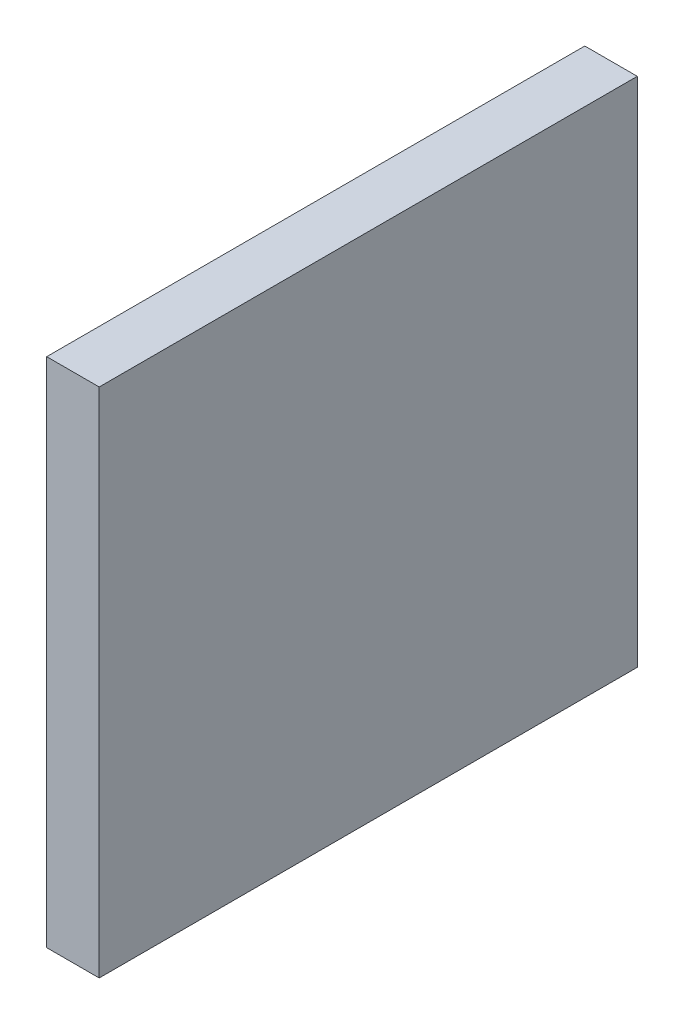
ISO-10303-21;
HEADER;
FILE_DESCRIPTION(('STEP AP214'),'2;1');
FILE_NAME('part.step','',(''),(''),'','','');
FILE_SCHEMA(('AUTOMOTIVE_DESIGN { 1 0 10303 214 1 1 1 1 }'));
ENDSEC;
DATA;
#1=APPLICATION_CONTEXT('core data for automotive mechanical design processes');
#2=APPLICATION_PROTOCOL_DEFINITION('international standard','automotive_design',2000,#1);
#3=PRODUCT_CONTEXT('',#1,'mechanical');
#4=PRODUCT('Part','Part','',(#3));
#5=PRODUCT_RELATED_PRODUCT_CATEGORY('part','',(#4));
#6=PRODUCT_DEFINITION_FORMATION('','',#4);
#7=PRODUCT_DEFINITION_CONTEXT('part definition',#1,'design');
#8=PRODUCT_DEFINITION('design','',#6,#7);
#9=PRODUCT_DEFINITION_SHAPE('','',#8);
#10=(LENGTH_UNIT() NAMED_UNIT(*) SI_UNIT(.MILLI.,.METRE.));
#11=(NAMED_UNIT(*) PLANE_ANGLE_UNIT() SI_UNIT($,.RADIAN.));
#12=(NAMED_UNIT(*) SI_UNIT($,.STERADIAN.) SOLID_ANGLE_UNIT());
#13=UNCERTAINTY_MEASURE_WITH_UNIT(LENGTH_MEASURE(1.E-05),#10,'distance_accuracy_value','');
#14=(GEOMETRIC_REPRESENTATION_CONTEXT(3) GLOBAL_UNCERTAINTY_ASSIGNED_CONTEXT((#13)) GLOBAL_UNIT_ASSIGNED_CONTEXT((#10,
#11,#12)) REPRESENTATION_CONTEXT('',''));
#15=CARTESIAN_POINT('',(0.,0.,0.));
#16=DIRECTION('',(0.,0.,1.));
#17=DIRECTION('',(1.,0.,0.));
#18=AXIS2_PLACEMENT_3D('',#15,#16,#17);
#19=CARTESIAN_POINT('',(4.,39.,-41.));
#20=DIRECTION('',(0.,0.,-1.));
#21=DIRECTION('',(0.,1.,0.));
#22=AXIS2_PLACEMENT_3D('',#19,#20,#21);
#23=PLANE('',#22);
#24=DIRECTION('',(0.,-1.,0.));
#25=VECTOR('',#24,1.);
#26=CARTESIAN_POINT('',(0.,39.,-41.));
#27=LINE('',#26,#25);
#28=CARTESIAN_POINT('',(0.,39.,-41.));
#29=VERTEX_POINT('',#28);
#30=CARTESIAN_POINT('',(0.,0.,-41.));
#31=VERTEX_POINT('',#30);
#32=EDGE_CURVE('E97',#29,#31,#27,.T.);
#33=ORIENTED_EDGE('',*,*,#32,.F.);
#34=DIRECTION('',(-1.,0.,0.));
#35=VECTOR('',#34,1.);
#36=CARTESIAN_POINT('',(4.,39.,-41.));
#37=LINE('',#36,#35);
#38=CARTESIAN_POINT('',(4.,39.,-41.));
#39=VERTEX_POINT('',#38);
#40=EDGE_CURVE('E11',#39,#29,#37,.T.);
#41=ORIENTED_EDGE('',*,*,#40,.F.);
#42=DIRECTION('',(0.,-1.,0.));
#43=VECTOR('',#42,1.);
#44=CARTESIAN_POINT('',(4.,39.,-41.));
#45=LINE('',#44,#43);
#46=CARTESIAN_POINT('',(4.,0.,-41.));
#47=VERTEX_POINT('',#46);
#48=EDGE_CURVE('E91',#39,#47,#45,.T.);
#49=ORIENTED_EDGE('',*,*,#48,.T.);
#50=DIRECTION('',(-1.,0.,0.));
#51=VECTOR('',#50,1.);
#52=CARTESIAN_POINT('',(4.,0.,-41.));
#53=LINE('',#52,#51);
#54=EDGE_CURVE('E36',#47,#31,#53,.T.);
#55=ORIENTED_EDGE('',*,*,#54,.T.);
#56=EDGE_LOOP('',(#33,#41,#49,#55));
#57=FACE_BOUND('',#56,.T.);
#58=ADVANCED_FACE('F33',(#57),#23,.T.);
#59=CARTESIAN_POINT('',(4.,39.,0.));
#60=DIRECTION('',(0.,1.,0.));
#61=DIRECTION('',(0.,0.,1.));
#62=AXIS2_PLACEMENT_3D('',#59,#60,#61);
#63=PLANE('',#62);
#64=DIRECTION('',(0.,0.,-1.));
#65=VECTOR('',#64,1.);
#66=CARTESIAN_POINT('',(0.,39.,0.));
#67=LINE('',#66,#65);
#68=CARTESIAN_POINT('',(0.,39.,0.));
#69=VERTEX_POINT('',#68);
#70=EDGE_CURVE('E93',#69,#29,#67,.T.);
#71=ORIENTED_EDGE('',*,*,#70,.F.);
#72=DIRECTION('',(-1.,0.,0.));
#73=VECTOR('',#72,1.);
#74=CARTESIAN_POINT('',(4.,39.,0.));
#75=LINE('',#74,#73);
#76=CARTESIAN_POINT('',(4.,39.,0.));
#77=VERTEX_POINT('',#76);
#78=EDGE_CURVE('E42',#77,#69,#75,.T.);
#79=ORIENTED_EDGE('',*,*,#78,.F.);
#80=DIRECTION('',(0.,0.,-1.));
#81=VECTOR('',#80,1.);
#82=CARTESIAN_POINT('',(4.,39.,0.));
#83=LINE('',#82,#81);
#84=EDGE_CURVE('E88',#77,#39,#83,.T.);
#85=ORIENTED_EDGE('',*,*,#84,.T.);
#86=ORIENTED_EDGE('',*,*,#40,.T.);
#87=EDGE_LOOP('',(#71,#79,#85,#86));
#88=FACE_BOUND('',#87,.T.);
#89=ADVANCED_FACE('F107',(#88),#63,.T.);
#90=CARTESIAN_POINT('',(4.,0.,0.));
#91=DIRECTION('',(0.,0.,1.));
#92=DIRECTION('',(0.,-1.,0.));
#93=AXIS2_PLACEMENT_3D('',#90,#91,#92);
#94=PLANE('',#93);
#95=DIRECTION('',(0.,1.,0.));
#96=VECTOR('',#95,1.);
#97=CARTESIAN_POINT('',(0.,0.,0.));
#98=LINE('',#97,#96);
#99=CARTESIAN_POINT('',(0.,0.,0.));
#100=VERTEX_POINT('',#99);
#101=EDGE_CURVE('E83',#100,#69,#98,.T.);
#102=ORIENTED_EDGE('',*,*,#101,.F.);
#103=DIRECTION('',(-1.,0.,0.));
#104=VECTOR('',#103,1.);
#105=CARTESIAN_POINT('',(4.,0.,0.));
#106=LINE('',#105,#104);
#107=CARTESIAN_POINT('',(4.,0.,0.));
#108=VERTEX_POINT('',#107);
#109=EDGE_CURVE('E78',#108,#100,#106,.T.);
#110=ORIENTED_EDGE('',*,*,#109,.F.);
#111=DIRECTION('',(0.,1.,0.));
#112=VECTOR('',#111,1.);
#113=CARTESIAN_POINT('',(4.,0.,0.));
#114=LINE('',#113,#112);
#115=EDGE_CURVE('E81',#108,#77,#114,.T.);
#116=ORIENTED_EDGE('',*,*,#115,.T.);
#117=ORIENTED_EDGE('',*,*,#78,.T.);
#118=EDGE_LOOP('',(#102,#110,#116,#117));
#119=FACE_BOUND('',#118,.T.);
#120=ADVANCED_FACE('F80',(#119),#94,.T.);
#121=CARTESIAN_POINT('',(4.,0.,-41.));
#122=DIRECTION('',(0.,-1.,0.));
#123=DIRECTION('',(0.,0.,-1.));
#124=AXIS2_PLACEMENT_3D('',#121,#122,#123);
#125=PLANE('',#124);
#126=DIRECTION('',(0.,0.,1.));
#127=VECTOR('',#126,1.);
#128=CARTESIAN_POINT('',(0.,0.,-41.));
#129=LINE('',#128,#127);
#130=EDGE_CURVE('E100',#31,#100,#129,.T.);
#131=ORIENTED_EDGE('',*,*,#130,.F.);
#132=ORIENTED_EDGE('',*,*,#54,.F.);
#133=DIRECTION('',(0.,0.,1.));
#134=VECTOR('',#133,1.);
#135=CARTESIAN_POINT('',(4.,0.,-41.));
#136=LINE('',#135,#134);
#137=EDGE_CURVE('E87',#47,#108,#136,.T.);
#138=ORIENTED_EDGE('',*,*,#137,.T.);
#139=ORIENTED_EDGE('',*,*,#109,.T.);
#140=EDGE_LOOP('',(#131,#132,#138,#139));
#141=FACE_BOUND('',#140,.T.);
#142=ADVANCED_FACE('F90',(#141),#125,.T.);
#143=CARTESIAN_POINT('',(4.,0.,0.));
#144=DIRECTION('',(-1.,0.,0.));
#145=DIRECTION('',(0.,0.,1.));
#146=AXIS2_PLACEMENT_3D('',#143,#144,#145);
#147=PLANE('',#146);
#148=ORIENTED_EDGE('',*,*,#48,.F.);
#149=ORIENTED_EDGE('',*,*,#84,.F.);
#150=ORIENTED_EDGE('',*,*,#115,.F.);
#151=ORIENTED_EDGE('',*,*,#137,.F.);
#152=EDGE_LOOP('',(#148,#149,#150,#151));
#153=FACE_BOUND('',#152,.T.);
#154=ADVANCED_FACE('F86',(#153),#147,.F.);
#155=CARTESIAN_POINT('',(0.,0.,0.));
#156=DIRECTION('',(-1.,0.,0.));
#157=DIRECTION('',(0.,0.,1.));
#158=AXIS2_PLACEMENT_3D('',#155,#156,#157);
#159=PLANE('',#158);
#160=ORIENTED_EDGE('',*,*,#32,.T.);
#161=ORIENTED_EDGE('',*,*,#130,.T.);
#162=ORIENTED_EDGE('',*,*,#101,.T.);
#163=ORIENTED_EDGE('',*,*,#70,.T.);
#164=EDGE_LOOP('',(#160,#161,#162,#163));
#165=FACE_BOUND('',#164,.T.);
#166=ADVANCED_FACE('F106',(#165),#159,.T.);
#167=CLOSED_SHELL('',(#58,#89,#120,#142,#154,#166));
#168=MANIFOLD_SOLID_BREP('B2',#167);
#169=ADVANCED_BREP_SHAPE_REPRESENTATION('',(#18,#168),#14);
#170=SHAPE_DEFINITION_REPRESENTATION(#9,#169);
ENDSEC;
END-ISO-10303-21;
